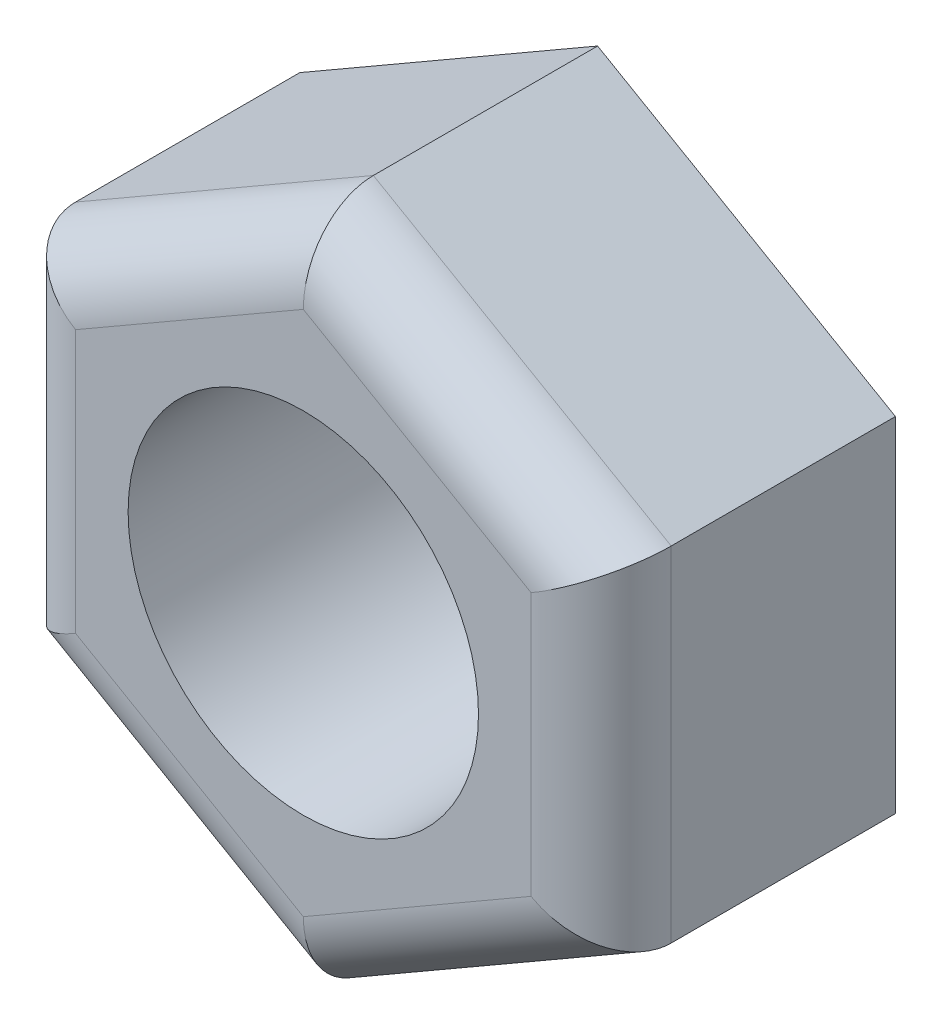
ISO-10303-21;
HEADER;
FILE_DESCRIPTION(('STEP AP214'),'2;1');
FILE_NAME('part.step','',(''),(''),'','','');
FILE_SCHEMA(('AUTOMOTIVE_DESIGN { 1 0 10303 214 1 1 1 1 }'));
ENDSEC;
DATA;
#1=APPLICATION_CONTEXT('core data for automotive mechanical design processes');
#2=APPLICATION_PROTOCOL_DEFINITION('international standard','automotive_design',2000,#1);
#3=PRODUCT_CONTEXT('',#1,'mechanical');
#4=PRODUCT('Part','Part','',(#3));
#5=PRODUCT_RELATED_PRODUCT_CATEGORY('part','',(#4));
#6=PRODUCT_DEFINITION_FORMATION('','',#4);
#7=PRODUCT_DEFINITION_CONTEXT('part definition',#1,'design');
#8=PRODUCT_DEFINITION('design','',#6,#7);
#9=PRODUCT_DEFINITION_SHAPE('','',#8);
#10=(LENGTH_UNIT() NAMED_UNIT(*) SI_UNIT(.MILLI.,.METRE.));
#11=(NAMED_UNIT(*) PLANE_ANGLE_UNIT() SI_UNIT($,.RADIAN.));
#12=(NAMED_UNIT(*) SI_UNIT($,.STERADIAN.) SOLID_ANGLE_UNIT());
#13=UNCERTAINTY_MEASURE_WITH_UNIT(LENGTH_MEASURE(1.E-05),#10,'distance_accuracy_value','');
#14=(GEOMETRIC_REPRESENTATION_CONTEXT(3) GLOBAL_UNCERTAINTY_ASSIGNED_CONTEXT((#13)) GLOBAL_UNIT_ASSIGNED_CONTEXT((#10,
#11,#12)) REPRESENTATION_CONTEXT('',''));
#15=CARTESIAN_POINT('',(0.,0.,0.));
#16=DIRECTION('',(0.,0.,1.));
#17=DIRECTION('',(1.,0.,0.));
#18=AXIS2_PLACEMENT_3D('',#15,#16,#17);
#19=CARTESIAN_POINT('',(8.50000000000001,-4.90747728811182,-8.4));
#20=DIRECTION('',(1.,0.,0.));
#21=DIRECTION('',(0.,0.,-1.));
#22=AXIS2_PLACEMENT_3D('',#19,#20,#21);
#23=PLANE('',#22);
#24=DIRECTION('',(0.,0.,1.));
#25=VECTOR('',#24,1.);
#26=CARTESIAN_POINT('',(8.50000000000001,4.90747728811182,-8.4));
#27=LINE('',#26,#25);
#28=CARTESIAN_POINT('',(8.50000000000001,4.90747728811182,-8.4));
#29=VERTEX_POINT('',#28);
#30=CARTESIAN_POINT('',(8.50000000000001,4.90747728811182,-2.));
#31=VERTEX_POINT('',#30);
#32=EDGE_CURVE('E104',#29,#31,#27,.T.);
#33=ORIENTED_EDGE('',*,*,#32,.T.);
#34=DIRECTION('',(0.,1.,0.));
#35=VECTOR('',#34,1.);
#36=CARTESIAN_POINT('',(8.50000000000001,-4.90747728811182,-2.));
#37=LINE('',#36,#35);
#38=CARTESIAN_POINT('',(8.50000000000001,-4.90747728811182,-2.));
#39=VERTEX_POINT('',#38);
#40=EDGE_CURVE('E169',#31,#39,#37,.F.);
#41=ORIENTED_EDGE('',*,*,#40,.T.);
#42=DIRECTION('',(0.,0.,1.));
#43=VECTOR('',#42,1.);
#44=CARTESIAN_POINT('',(8.50000000000001,-4.90747728811182,-8.4));
#45=LINE('',#44,#43);
#46=CARTESIAN_POINT('',(8.50000000000001,-4.90747728811182,-8.4));
#47=VERTEX_POINT('',#46);
#48=EDGE_CURVE('E129',#47,#39,#45,.T.);
#49=ORIENTED_EDGE('',*,*,#48,.F.);
#50=DIRECTION('',(0.,1.,0.));
#51=VECTOR('',#50,1.);
#52=CARTESIAN_POINT('',(8.50000000000001,-4.90747728811182,-8.4));
#53=LINE('',#52,#51);
#54=EDGE_CURVE('E122',#47,#29,#53,.T.);
#55=ORIENTED_EDGE('',*,*,#54,.T.);
#56=EDGE_LOOP('',(#33,#41,#49,#55));
#57=FACE_BOUND('',#56,.T.);
#58=ADVANCED_FACE('F33',(#57),#23,.T.);
#59=CARTESIAN_POINT('',(0.,-9.81495457622364,-8.4));
#60=DIRECTION('',(0.5,-0.866025403784439,0.));
#61=DIRECTION('',(0.866025403784439,0.5,0.));
#62=AXIS2_PLACEMENT_3D('',#59,#60,#61);
#63=PLANE('',#62);
#64=ORIENTED_EDGE('',*,*,#48,.T.);
#65=DIRECTION('',(0.866025403784439,0.5,0.));
#66=VECTOR('',#65,1.);
#67=CARTESIAN_POINT('',(0.,-9.81495457622364,-2.));
#68=LINE('',#67,#66);
#69=CARTESIAN_POINT('',(0.,-9.81495457622364,-2.));
#70=VERTEX_POINT('',#69);
#71=EDGE_CURVE('E166',#39,#70,#68,.F.);
#72=ORIENTED_EDGE('',*,*,#71,.T.);
#73=DIRECTION('',(0.,0.,1.));
#74=VECTOR('',#73,1.);
#75=CARTESIAN_POINT('',(0.,-9.81495457622364,-8.4));
#76=LINE('',#75,#74);
#77=CARTESIAN_POINT('',(0.,-9.81495457622364,-8.4));
#78=VERTEX_POINT('',#77);
#79=EDGE_CURVE('E147',#78,#70,#76,.T.);
#80=ORIENTED_EDGE('',*,*,#79,.F.);
#81=DIRECTION('',(0.866025403784439,0.5,0.));
#82=VECTOR('',#81,1.);
#83=CARTESIAN_POINT('',(0.,-9.81495457622364,-8.4));
#84=LINE('',#83,#82);
#85=EDGE_CURVE('E115',#78,#47,#84,.T.);
#86=ORIENTED_EDGE('',*,*,#85,.T.);
#87=EDGE_LOOP('',(#64,#72,#80,#86));
#88=FACE_BOUND('',#87,.T.);
#89=ADVANCED_FACE('F212',(#88),#63,.T.);
#90=CARTESIAN_POINT('',(-8.5,-4.90747728811182,-8.4));
#91=DIRECTION('',(-0.5,-0.866025403784438,0.));
#92=DIRECTION('',(0.866025403784439,-0.5,0.));
#93=AXIS2_PLACEMENT_3D('',#90,#91,#92);
#94=PLANE('',#93);
#95=ORIENTED_EDGE('',*,*,#79,.T.);
#96=DIRECTION('',(0.866025403784439,-0.5,0.));
#97=VECTOR('',#96,1.);
#98=CARTESIAN_POINT('',(-8.5,-4.90747728811182,-2.));
#99=LINE('',#98,#97);
#100=CARTESIAN_POINT('',(-8.5,-4.90747728811182,-2.));
#101=VERTEX_POINT('',#100);
#102=EDGE_CURVE('E11',#70,#101,#99,.F.);
#103=ORIENTED_EDGE('',*,*,#102,.T.);
#104=DIRECTION('',(0.,0.,1.));
#105=VECTOR('',#104,1.);
#106=CARTESIAN_POINT('',(-8.5,-4.90747728811182,-8.4));
#107=LINE('',#106,#105);
#108=CARTESIAN_POINT('',(-8.5,-4.90747728811182,-8.4));
#109=VERTEX_POINT('',#108);
#110=EDGE_CURVE('E149',#109,#101,#107,.T.);
#111=ORIENTED_EDGE('',*,*,#110,.F.);
#112=DIRECTION('',(0.866025403784439,-0.5,0.));
#113=VECTOR('',#112,1.);
#114=CARTESIAN_POINT('',(-8.5,-4.90747728811182,-8.4));
#115=LINE('',#114,#113);
#116=EDGE_CURVE('E141',#109,#78,#115,.T.);
#117=ORIENTED_EDGE('',*,*,#116,.T.);
#118=EDGE_LOOP('',(#95,#103,#111,#117));
#119=FACE_BOUND('',#118,.T.);
#120=ADVANCED_FACE('F217',(#119),#94,.T.);
#121=CARTESIAN_POINT('',(-8.5,4.90747728811183,-8.4));
#122=DIRECTION('',(-1.,0.,0.));
#123=DIRECTION('',(0.,0.,1.));
#124=AXIS2_PLACEMENT_3D('',#121,#122,#123);
#125=PLANE('',#124);
#126=ORIENTED_EDGE('',*,*,#110,.T.);
#127=DIRECTION('',(0.,-1.,0.));
#128=VECTOR('',#127,1.);
#129=CARTESIAN_POINT('',(-8.5,4.90747728811183,-2.));
#130=LINE('',#129,#128);
#131=CARTESIAN_POINT('',(-8.5,4.90747728811183,-2.));
#132=VERTEX_POINT('',#131);
#133=EDGE_CURVE('E42',#101,#132,#130,.F.);
#134=ORIENTED_EDGE('',*,*,#133,.T.);
#135=DIRECTION('',(0.,0.,1.));
#136=VECTOR('',#135,1.);
#137=CARTESIAN_POINT('',(-8.5,4.90747728811183,-8.4));
#138=LINE('',#137,#136);
#139=CARTESIAN_POINT('',(-8.5,4.90747728811183,-8.4));
#140=VERTEX_POINT('',#139);
#141=EDGE_CURVE('E151',#140,#132,#138,.T.);
#142=ORIENTED_EDGE('',*,*,#141,.F.);
#143=DIRECTION('',(0.,-1.,0.));
#144=VECTOR('',#143,1.);
#145=CARTESIAN_POINT('',(-8.5,4.90747728811183,-8.4));
#146=LINE('',#145,#144);
#147=EDGE_CURVE('E138',#140,#109,#146,.T.);
#148=ORIENTED_EDGE('',*,*,#147,.T.);
#149=EDGE_LOOP('',(#126,#134,#142,#148));
#150=FACE_BOUND('',#149,.T.);
#151=ADVANCED_FACE('F255',(#150),#125,.T.);
#152=CARTESIAN_POINT('',(0.,9.81495457622364,-8.4));
#153=DIRECTION('',(-0.5,0.866025403784439,0.));
#154=DIRECTION('',(-0.866025403784439,-0.5,0.));
#155=AXIS2_PLACEMENT_3D('',#152,#153,#154);
#156=PLANE('',#155);
#157=ORIENTED_EDGE('',*,*,#141,.T.);
#158=DIRECTION('',(-0.866025403784439,-0.5,0.));
#159=VECTOR('',#158,1.);
#160=CARTESIAN_POINT('',(0.,9.81495457622364,-2.));
#161=LINE('',#160,#159);
#162=CARTESIAN_POINT('',(0.,9.81495457622364,-2.));
#163=VERTEX_POINT('',#162);
#164=EDGE_CURVE('E171',#132,#163,#161,.F.);
#165=ORIENTED_EDGE('',*,*,#164,.T.);
#166=DIRECTION('',(0.,0.,1.));
#167=VECTOR('',#166,1.);
#168=CARTESIAN_POINT('',(0.,9.81495457622364,-8.4));
#169=LINE('',#168,#167);
#170=CARTESIAN_POINT('',(0.,9.81495457622364,-8.4));
#171=VERTEX_POINT('',#170);
#172=EDGE_CURVE('E114',#171,#163,#169,.T.);
#173=ORIENTED_EDGE('',*,*,#172,.F.);
#174=DIRECTION('',(-0.866025403784439,-0.5,0.));
#175=VECTOR('',#174,1.);
#176=CARTESIAN_POINT('',(0.,9.81495457622364,-8.4));
#177=LINE('',#176,#175);
#178=EDGE_CURVE('E126',#171,#140,#177,.T.);
#179=ORIENTED_EDGE('',*,*,#178,.T.);
#180=EDGE_LOOP('',(#157,#165,#173,#179));
#181=FACE_BOUND('',#180,.T.);
#182=ADVANCED_FACE('F257',(#181),#156,.T.);
#183=CARTESIAN_POINT('',(8.50000000000001,4.90747728811182,-8.4));
#184=DIRECTION('',(0.5,0.866025403784438,0.));
#185=DIRECTION('',(-0.866025403784439,0.5,0.));
#186=AXIS2_PLACEMENT_3D('',#183,#184,#185);
#187=PLANE('',#186);
#188=ORIENTED_EDGE('',*,*,#172,.T.);
#189=DIRECTION('',(-0.866025403784439,0.5,0.));
#190=VECTOR('',#189,1.);
#191=CARTESIAN_POINT('',(8.50000000000001,4.90747728811182,-2.));
#192=LINE('',#191,#190);
#193=EDGE_CURVE('E110',#163,#31,#192,.F.);
#194=ORIENTED_EDGE('',*,*,#193,.T.);
#195=ORIENTED_EDGE('',*,*,#32,.F.);
#196=DIRECTION('',(-0.866025403784439,0.5,0.));
#197=VECTOR('',#196,1.);
#198=CARTESIAN_POINT('',(8.50000000000001,4.90747728811182,-8.4));
#199=LINE('',#198,#197);
#200=EDGE_CURVE('E108',#29,#171,#199,.T.);
#201=ORIENTED_EDGE('',*,*,#200,.T.);
#202=EDGE_LOOP('',(#188,#194,#195,#201));
#203=FACE_BOUND('',#202,.T.);
#204=ADVANCED_FACE('F107',(#203),#187,.T.);
#205=CARTESIAN_POINT('',(0.,0.,-8.4));
#206=DIRECTION('',(0.,0.,1.));
#207=DIRECTION('',(1.,0.,0.));
#208=AXIS2_PLACEMENT_3D('',#205,#206,#207);
#209=PLANE('',#208);
#210=CARTESIAN_POINT('',(0.,0.,-8.4));
#211=DIRECTION('',(0.,0.,1.));
#212=DIRECTION('',(1.,0.,0.));
#213=AXIS2_PLACEMENT_3D('',#210,#211,#212);
#214=CIRCLE('',#213,5.);
#215=CARTESIAN_POINT('',(5.,0.,-8.4));
#216=VERTEX_POINT('',#215);
#217=EDGE_CURVE('E130',#216,#216,#214,.T.);
#218=ORIENTED_EDGE('',*,*,#217,.T.);
#219=EDGE_LOOP('',(#218));
#220=FACE_BOUND('',#219,.T.);
#221=ORIENTED_EDGE('',*,*,#54,.F.);
#222=ORIENTED_EDGE('',*,*,#85,.F.);
#223=ORIENTED_EDGE('',*,*,#116,.F.);
#224=ORIENTED_EDGE('',*,*,#147,.F.);
#225=ORIENTED_EDGE('',*,*,#178,.F.);
#226=ORIENTED_EDGE('',*,*,#200,.F.);
#227=EDGE_LOOP('',(#221,#222,#223,#224,#225,#226));
#228=FACE_BOUND('',#227,.T.);
#229=ADVANCED_FACE('F120',(#220,#228),#209,.F.);
#230=CARTESIAN_POINT('',(0.,0.,0.));
#231=DIRECTION('',(0.,0.,1.));
#232=DIRECTION('',(1.,0.,0.));
#233=AXIS2_PLACEMENT_3D('',#230,#231,#232);
#234=PLANE('',#233);
#235=DIRECTION('',(0.866025403784439,0.5,0.));
#236=VECTOR('',#235,1.);
#237=CARTESIAN_POINT('',(3.25,-5.62916512459886,0.));
#238=LINE('',#237,#236);
#239=CARTESIAN_POINT('',(0.,-7.50555349946514,0.));
#240=VERTEX_POINT('',#239);
#241=CARTESIAN_POINT('',(6.50000000000001,-3.75277674973257,0.));
#242=VERTEX_POINT('',#241);
#243=EDGE_CURVE('E159',#240,#242,#238,.T.);
#244=ORIENTED_EDGE('',*,*,#243,.T.);
#245=DIRECTION('',(0.,1.,0.));
#246=VECTOR('',#245,1.);
#247=CARTESIAN_POINT('',(6.50000000000001,0.,0.));
#248=LINE('',#247,#246);
#249=CARTESIAN_POINT('',(6.50000000000001,3.75277674973257,0.));
#250=VERTEX_POINT('',#249);
#251=EDGE_CURVE('E164',#242,#250,#248,.T.);
#252=ORIENTED_EDGE('',*,*,#251,.T.);
#253=DIRECTION('',(-0.866025403784439,0.5,0.));
#254=VECTOR('',#253,1.);
#255=CARTESIAN_POINT('',(3.25,5.62916512459885,0.));
#256=LINE('',#255,#254);
#257=CARTESIAN_POINT('',(0.,7.50555349946514,0.));
#258=VERTEX_POINT('',#257);
#259=EDGE_CURVE('E162',#250,#258,#256,.T.);
#260=ORIENTED_EDGE('',*,*,#259,.T.);
#261=DIRECTION('',(-0.866025403784439,-0.5,0.));
#262=VECTOR('',#261,1.);
#263=CARTESIAN_POINT('',(-3.25,5.62916512459886,0.));
#264=LINE('',#263,#262);
#265=CARTESIAN_POINT('',(-6.5,3.75277674973258,0.));
#266=VERTEX_POINT('',#265);
#267=EDGE_CURVE('E157',#258,#266,#264,.T.);
#268=ORIENTED_EDGE('',*,*,#267,.T.);
#269=DIRECTION('',(0.,-1.,0.));
#270=VECTOR('',#269,1.);
#271=CARTESIAN_POINT('',(-6.5,0.,0.));
#272=LINE('',#271,#270);
#273=CARTESIAN_POINT('',(-6.5,-3.75277674973257,0.));
#274=VERTEX_POINT('',#273);
#275=EDGE_CURVE('E155',#266,#274,#272,.T.);
#276=ORIENTED_EDGE('',*,*,#275,.T.);
#277=DIRECTION('',(0.866025403784439,-0.5,0.));
#278=VECTOR('',#277,1.);
#279=CARTESIAN_POINT('',(-3.25,-5.62916512459885,0.));
#280=LINE('',#279,#278);
#281=EDGE_CURVE('E146',#274,#240,#280,.T.);
#282=ORIENTED_EDGE('',*,*,#281,.T.);
#283=EDGE_LOOP('',(#244,#252,#260,#268,#276,#282));
#284=FACE_BOUND('',#283,.T.);
#285=CARTESIAN_POINT('',(0.,0.,0.));
#286=DIRECTION('',(0.,0.,1.));
#287=DIRECTION('',(1.,0.,0.));
#288=AXIS2_PLACEMENT_3D('',#285,#286,#287);
#289=CIRCLE('',#288,5.);
#290=CARTESIAN_POINT('',(5.,0.,0.));
#291=VERTEX_POINT('',#290);
#292=EDGE_CURVE('E133',#291,#291,#289,.T.);
#293=ORIENTED_EDGE('',*,*,#292,.F.);
#294=EDGE_LOOP('',(#293));
#295=FACE_BOUND('',#294,.T.);
#296=ADVANCED_FACE('F198',(#284,#295),#234,.T.);
#297=CARTESIAN_POINT('',(0.,0.,-8.4));
#298=DIRECTION('',(0.,0.,1.));
#299=DIRECTION('',(1.,0.,0.));
#300=AXIS2_PLACEMENT_3D('',#297,#298,#299);
#301=CYLINDRICAL_SURFACE('',#300,5.);
#302=ORIENTED_EDGE('',*,*,#217,.F.);
#303=EDGE_LOOP('',(#302));
#304=FACE_BOUND('',#303,.T.);
#305=ORIENTED_EDGE('',*,*,#292,.T.);
#306=EDGE_LOOP('',(#305));
#307=FACE_BOUND('',#306,.T.);
#308=ADVANCED_FACE('F196',(#304,#307),#301,.F.);
#309=CARTESIAN_POINT('',(-3.25,5.62916512459886,-2.));
#310=DIRECTION('',(-0.866025403784439,-0.5,0.));
#311=DIRECTION('',(0.5,-0.866025403784439,0.));
#312=AXIS2_PLACEMENT_3D('',#309,#310,#311);
#313=CYLINDRICAL_SURFACE('',#312,2.);
#314=CARTESIAN_POINT('',(0.,7.50555349946514,-2.));
#315=DIRECTION('',(-1.,0.,0.));
#316=DIRECTION('',(0.,1.,0.));
#317=AXIS2_PLACEMENT_3D('',#314,#315,#316);
#318=ELLIPSE('',#317,2.3094010767585,2.);
#319=EDGE_CURVE('E184',#163,#258,#318,.F.);
#320=ORIENTED_EDGE('',*,*,#319,.F.);
#321=ORIENTED_EDGE('',*,*,#164,.F.);
#322=CARTESIAN_POINT('',(-6.5,3.75277674973257,-2.));
#323=DIRECTION('',(-0.5,-0.866025403784439,0.));
#324=DIRECTION('',(0.866025403784439,-0.5,0.));
#325=AXIS2_PLACEMENT_3D('',#322,#323,#324);
#326=ELLIPSE('',#325,2.3094010767585,2.);
#327=EDGE_CURVE('E37',#266,#132,#326,.T.);
#328=ORIENTED_EDGE('',*,*,#327,.F.);
#329=ORIENTED_EDGE('',*,*,#267,.F.);
#330=EDGE_LOOP('',(#320,#321,#328,#329));
#331=FACE_BOUND('',#330,.T.);
#332=ADVANCED_FACE('F35',(#331),#313,.T.);
#333=CARTESIAN_POINT('',(-6.5,0.,-2.));
#334=DIRECTION('',(0.,-1.,0.));
#335=DIRECTION('',(0.,0.,-1.));
#336=AXIS2_PLACEMENT_3D('',#333,#334,#335);
#337=CYLINDRICAL_SURFACE('',#336,2.);
#338=ORIENTED_EDGE('',*,*,#327,.T.);
#339=ORIENTED_EDGE('',*,*,#133,.F.);
#340=CARTESIAN_POINT('',(-6.5,-3.75277674973257,-2.));
#341=DIRECTION('',(0.5,-0.866025403784439,0.));
#342=DIRECTION('',(0.866025403784439,0.5,0.));
#343=AXIS2_PLACEMENT_3D('',#340,#341,#342);
#344=ELLIPSE('',#343,2.3094010767585,2.);
#345=EDGE_CURVE('E182',#274,#101,#344,.T.);
#346=ORIENTED_EDGE('',*,*,#345,.F.);
#347=ORIENTED_EDGE('',*,*,#275,.F.);
#348=EDGE_LOOP('',(#338,#339,#346,#347));
#349=FACE_BOUND('',#348,.T.);
#350=ADVANCED_FACE('F236',(#349),#337,.T.);
#351=CARTESIAN_POINT('',(3.25,5.62916512459886,-2.));
#352=DIRECTION('',(-0.866025403784439,0.5,0.));
#353=DIRECTION('',(-0.5,-0.866025403784438,0.));
#354=AXIS2_PLACEMENT_3D('',#351,#352,#353);
#355=CYLINDRICAL_SURFACE('',#354,2.);
#356=ORIENTED_EDGE('',*,*,#319,.T.);
#357=ORIENTED_EDGE('',*,*,#259,.F.);
#358=CARTESIAN_POINT('',(6.50000000000001,3.75277674973257,-2.));
#359=DIRECTION('',(-0.5,0.866025403784439,0.));
#360=DIRECTION('',(-0.866025403784439,-0.5,0.));
#361=AXIS2_PLACEMENT_3D('',#358,#359,#360);
#362=ELLIPSE('',#361,2.3094010767585,2.);
#363=EDGE_CURVE('E179',#31,#250,#362,.F.);
#364=ORIENTED_EDGE('',*,*,#363,.F.);
#365=ORIENTED_EDGE('',*,*,#193,.F.);
#366=EDGE_LOOP('',(#356,#357,#364,#365));
#367=FACE_BOUND('',#366,.T.);
#368=ADVANCED_FACE('F233',(#367),#355,.T.);
#369=CARTESIAN_POINT('',(-3.25,-5.62916512459885,-2.));
#370=DIRECTION('',(0.866025403784439,-0.5,0.));
#371=DIRECTION('',(0.5,0.866025403784438,0.));
#372=AXIS2_PLACEMENT_3D('',#369,#370,#371);
#373=CYLINDRICAL_SURFACE('',#372,2.);
#374=ORIENTED_EDGE('',*,*,#345,.T.);
#375=ORIENTED_EDGE('',*,*,#102,.F.);
#376=CARTESIAN_POINT('',(0.,-7.50555349946514,-2.));
#377=DIRECTION('',(1.,0.,0.));
#378=DIRECTION('',(0.,-1.,0.));
#379=AXIS2_PLACEMENT_3D('',#376,#377,#378);
#380=ELLIPSE('',#379,2.3094010767585,2.);
#381=EDGE_CURVE('E177',#240,#70,#380,.T.);
#382=ORIENTED_EDGE('',*,*,#381,.F.);
#383=ORIENTED_EDGE('',*,*,#281,.F.);
#384=EDGE_LOOP('',(#374,#375,#382,#383));
#385=FACE_BOUND('',#384,.T.);
#386=ADVANCED_FACE('F229',(#385),#373,.T.);
#387=CARTESIAN_POINT('',(6.50000000000001,0.,-2.));
#388=DIRECTION('',(0.,1.,0.));
#389=DIRECTION('',(0.,0.,1.));
#390=AXIS2_PLACEMENT_3D('',#387,#388,#389);
#391=CYLINDRICAL_SURFACE('',#390,2.);
#392=ORIENTED_EDGE('',*,*,#363,.T.);
#393=ORIENTED_EDGE('',*,*,#251,.F.);
#394=CARTESIAN_POINT('',(6.50000000000001,-3.75277674973257,-2.));
#395=DIRECTION('',(0.5,0.866025403784439,0.));
#396=DIRECTION('',(-0.866025403784439,0.5,0.));
#397=AXIS2_PLACEMENT_3D('',#394,#395,#396);
#398=ELLIPSE('',#397,2.3094010767585,2.);
#399=EDGE_CURVE('E175',#39,#242,#398,.F.);
#400=ORIENTED_EDGE('',*,*,#399,.F.);
#401=ORIENTED_EDGE('',*,*,#40,.F.);
#402=EDGE_LOOP('',(#392,#393,#400,#401));
#403=FACE_BOUND('',#402,.T.);
#404=ADVANCED_FACE('F225',(#403),#391,.T.);
#405=CARTESIAN_POINT('',(3.25,-5.62916512459886,-2.));
#406=DIRECTION('',(0.866025403784439,0.5,0.));
#407=DIRECTION('',(-0.5,0.866025403784439,0.));
#408=AXIS2_PLACEMENT_3D('',#405,#406,#407);
#409=CYLINDRICAL_SURFACE('',#408,2.);
#410=ORIENTED_EDGE('',*,*,#381,.T.);
#411=ORIENTED_EDGE('',*,*,#71,.F.);
#412=ORIENTED_EDGE('',*,*,#399,.T.);
#413=ORIENTED_EDGE('',*,*,#243,.F.);
#414=EDGE_LOOP('',(#410,#411,#412,#413));
#415=FACE_BOUND('',#414,.T.);
#416=ADVANCED_FACE('F222',(#415),#409,.T.);
#417=CLOSED_SHELL('',(#58,#89,#120,#151,#182,#204,#229,#296,#308,#332,#350,#368,#386,#404,#416));
#418=MANIFOLD_SOLID_BREP('B2',#417);
#419=ADVANCED_BREP_SHAPE_REPRESENTATION('',(#18,#418),#14);
#420=SHAPE_DEFINITION_REPRESENTATION(#9,#419);
ENDSEC;
END-ISO-10303-21;
